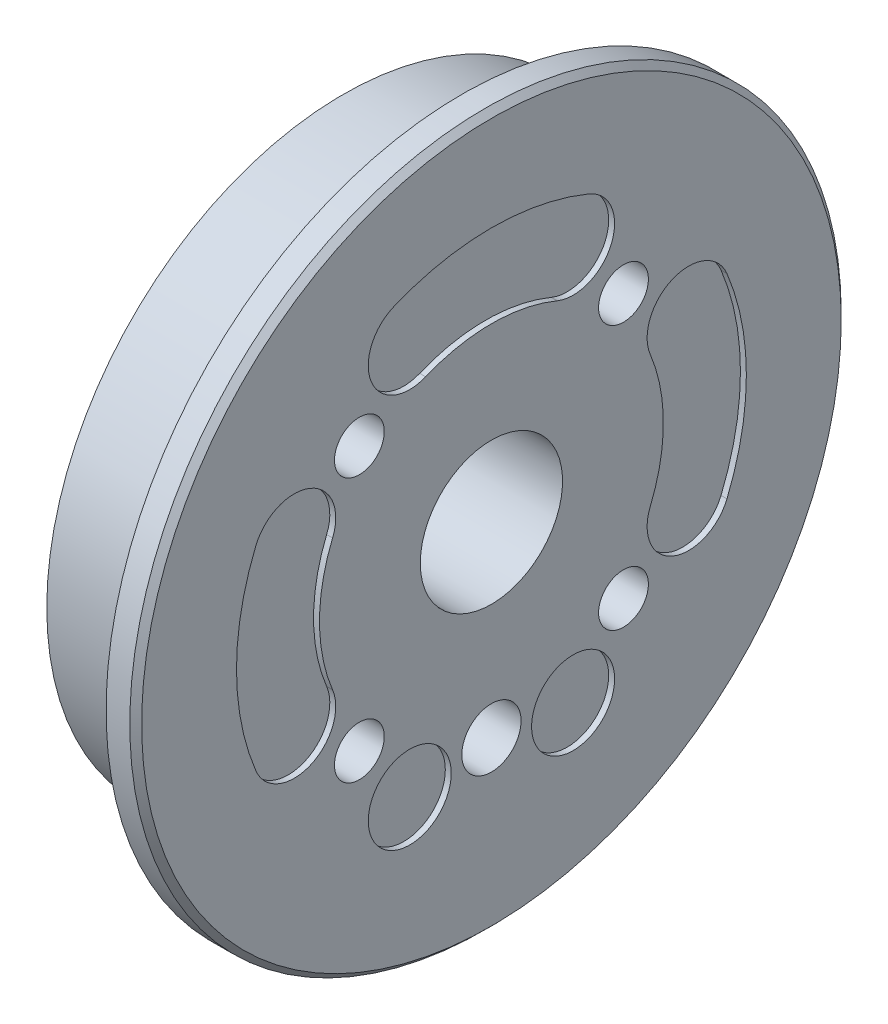
ISO-10303-21;
HEADER;
FILE_DESCRIPTION(('STEP AP214'),'2;1');
FILE_NAME('part.step','',(''),(''),'','','');
FILE_SCHEMA(('AUTOMOTIVE_DESIGN { 1 0 10303 214 1 1 1 1 }'));
ENDSEC;
DATA;
#1=APPLICATION_CONTEXT('core data for automotive mechanical design processes');
#2=APPLICATION_PROTOCOL_DEFINITION('international standard','automotive_design',2000,#1);
#3=PRODUCT_CONTEXT('',#1,'mechanical');
#4=PRODUCT('Part','Part','',(#3));
#5=PRODUCT_RELATED_PRODUCT_CATEGORY('part','',(#4));
#6=PRODUCT_DEFINITION_FORMATION('','',#4);
#7=PRODUCT_DEFINITION_CONTEXT('part definition',#1,'design');
#8=PRODUCT_DEFINITION('design','',#6,#7);
#9=PRODUCT_DEFINITION_SHAPE('','',#8);
#10=(LENGTH_UNIT() NAMED_UNIT(*) SI_UNIT(.MILLI.,.METRE.));
#11=(NAMED_UNIT(*) PLANE_ANGLE_UNIT() SI_UNIT($,.RADIAN.));
#12=(NAMED_UNIT(*) SI_UNIT($,.STERADIAN.) SOLID_ANGLE_UNIT());
#13=UNCERTAINTY_MEASURE_WITH_UNIT(LENGTH_MEASURE(1.E-05),#10,'distance_accuracy_value','');
#14=(GEOMETRIC_REPRESENTATION_CONTEXT(3) GLOBAL_UNCERTAINTY_ASSIGNED_CONTEXT((#13)) GLOBAL_UNIT_ASSIGNED_CONTEXT((#10,
#11,#12)) REPRESENTATION_CONTEXT('',''));
#15=CARTESIAN_POINT('',(0.,0.,0.));
#16=DIRECTION('',(0.,0.,1.));
#17=DIRECTION('',(1.,0.,0.));
#18=AXIS2_PLACEMENT_3D('',#15,#16,#17);
#19=CARTESIAN_POINT('',(12.5,0.,0.));
#20=DIRECTION('',(1.,0.,0.));
#21=DIRECTION('',(0.,0.,-1.));
#22=AXIS2_PLACEMENT_3D('',#19,#20,#21);
#23=PLANE('',#22);
#24=CARTESIAN_POINT('',(12.5,0.,0.));
#25=DIRECTION('',(1.,0.,0.));
#26=DIRECTION('',(0.,0.,-1.));
#27=AXIS2_PLACEMENT_3D('',#24,#25,#26);
#28=CIRCLE('',#27,29.5);
#29=CARTESIAN_POINT('',(12.5,0.,-29.5));
#30=VERTEX_POINT('',#29);
#31=EDGE_CURVE('E44',#30,#30,#28,.T.);
#32=ORIENTED_EDGE('',*,*,#31,.T.);
#33=EDGE_LOOP('',(#32));
#34=FACE_BOUND('',#33,.T.);
#35=CARTESIAN_POINT('',(12.5,-15.75,0.));
#36=DIRECTION('',(1.,0.,0.));
#37=DIRECTION('',(0.,0.,-1.));
#38=AXIS2_PLACEMENT_3D('',#35,#36,#37);
#39=CIRCLE('',#38,2.49999999999999);
#40=CARTESIAN_POINT('',(12.5,-15.75,-2.49999999999999));
#41=VERTEX_POINT('',#40);
#42=EDGE_CURVE('E383',#41,#41,#39,.T.);
#43=ORIENTED_EDGE('',*,*,#42,.F.);
#44=EDGE_LOOP('',(#43));
#45=FACE_BOUND('',#44,.T.);
#46=CARTESIAN_POINT('',(12.5,-11.13693180369,-11.13693180369));
#47=DIRECTION('',(-1.,0.,0.));
#48=DIRECTION('',(0.,0.,1.));
#49=AXIS2_PLACEMENT_3D('',#46,#47,#48);
#50=CIRCLE('',#49,2.09999999999999);
#51=CARTESIAN_POINT('',(12.5,-11.13693180369,-9.03693180369001));
#52=VERTEX_POINT('',#51);
#53=EDGE_CURVE('E386',#52,#52,#50,.T.);
#54=ORIENTED_EDGE('',*,*,#53,.T.);
#55=EDGE_LOOP('',(#54));
#56=FACE_BOUND('',#55,.T.);
#57=CARTESIAN_POINT('',(12.5,11.13693180369,-11.13693180369));
#58=DIRECTION('',(-1.,0.,0.));
#59=DIRECTION('',(0.,0.,1.));
#60=AXIS2_PLACEMENT_3D('',#57,#58,#59);
#61=CIRCLE('',#60,2.09999999999999);
#62=CARTESIAN_POINT('',(12.5,11.13693180369,-9.03693180369001));
#63=VERTEX_POINT('',#62);
#64=EDGE_CURVE('E396',#63,#63,#61,.T.);
#65=ORIENTED_EDGE('',*,*,#64,.T.);
#66=EDGE_LOOP('',(#65));
#67=FACE_BOUND('',#66,.T.);
#68=CARTESIAN_POINT('',(12.5,11.13693180369,11.13693180369));
#69=DIRECTION('',(-1.,0.,0.));
#70=DIRECTION('',(0.,0.,1.));
#71=AXIS2_PLACEMENT_3D('',#68,#69,#70);
#72=CIRCLE('',#71,2.09999999999999);
#73=CARTESIAN_POINT('',(12.5,11.13693180369,13.23693180369));
#74=VERTEX_POINT('',#73);
#75=EDGE_CURVE('E402',#74,#74,#72,.T.);
#76=ORIENTED_EDGE('',*,*,#75,.T.);
#77=EDGE_LOOP('',(#76));
#78=FACE_BOUND('',#77,.T.);
#79=CARTESIAN_POINT('',(12.5,-11.13693180369,11.13693180369));
#80=DIRECTION('',(-1.,0.,0.));
#81=DIRECTION('',(0.,0.,1.));
#82=AXIS2_PLACEMENT_3D('',#79,#80,#81);
#83=CIRCLE('',#82,2.09999999999999);
#84=CARTESIAN_POINT('',(12.5,-11.13693180369,13.23693180369));
#85=VERTEX_POINT('',#84);
#86=EDGE_CURVE('E408',#85,#85,#83,.T.);
#87=ORIENTED_EDGE('',*,*,#86,.T.);
#88=EDGE_LOOP('',(#87));
#89=FACE_BOUND('',#88,.T.);
#90=CARTESIAN_POINT('',(12.5,-16.6298315852,6.888301782572));
#91=DIRECTION('',(1.,0.,0.));
#92=DIRECTION('',(0.,0.,-1.));
#93=AXIS2_PLACEMENT_3D('',#90,#91,#92);
#94=CIRCLE('',#93,3.49999999999999);
#95=CARTESIAN_POINT('',(12.5,-16.6298315852,3.38830178257201));
#96=VERTEX_POINT('',#95);
#97=EDGE_CURVE('E411',#96,#96,#94,.T.);
#98=ORIENTED_EDGE('',*,*,#97,.F.);
#99=EDGE_LOOP('',(#98));
#100=FACE_BOUND('',#99,.T.);
#101=CARTESIAN_POINT('',(12.5,-16.6298315852,-6.888301782572));
#102=DIRECTION('',(1.,0.,0.));
#103=DIRECTION('',(0.,0.,-1.));
#104=AXIS2_PLACEMENT_3D('',#101,#102,#103);
#105=CIRCLE('',#104,3.49999999999999);
#106=CARTESIAN_POINT('',(12.5,-16.6298315852,-10.388301782572));
#107=VERTEX_POINT('',#106);
#108=EDGE_CURVE('E417',#107,#107,#105,.T.);
#109=ORIENTED_EDGE('',*,*,#108,.F.);
#110=EDGE_LOOP('',(#109));
#111=FACE_BOUND('',#110,.T.);
#112=CARTESIAN_POINT('',(12.5,0.,0.));
#113=DIRECTION('',(-1.,0.,0.));
#114=DIRECTION('',(0.,0.,1.));
#115=AXIS2_PLACEMENT_3D('',#112,#113,#114);
#116=CIRCLE('',#115,5.99999999999999);
#117=CARTESIAN_POINT('',(12.5,0.,5.99999999999999));
#118=VERTEX_POINT('',#117);
#119=EDGE_CURVE('E151',#118,#118,#116,.T.);
#120=ORIENTED_EDGE('',*,*,#119,.T.);
#121=EDGE_LOOP('',(#120));
#122=FACE_BOUND('',#121,.T.);
#123=CARTESIAN_POINT('',(12.5,16.6298315852,6.888301782572));
#124=DIRECTION('',(1.,0.,0.));
#125=DIRECTION('',(0.,0.,-1.));
#126=AXIS2_PLACEMENT_3D('',#123,#124,#125);
#127=CIRCLE('',#126,3.5000000000014);
#128=CARTESIAN_POINT('',(12.5,19.8634099489907,8.22769379585063));
#129=VERTEX_POINT('',#128);
#130=CARTESIAN_POINT('',(12.5,13.3962532214093,5.54890976929337));
#131=VERTEX_POINT('',#130);
#132=EDGE_CURVE('E59',#129,#131,#127,.T.);
#133=ORIENTED_EDGE('',*,*,#132,.F.);
#134=CARTESIAN_POINT('',(12.5,-2.57086019139763E-12,-1.06425285251177E-12));
#135=DIRECTION('',(1.,0.,0.));
#136=DIRECTION('',(0.,0.,-1.));
#137=AXIS2_PLACEMENT_3D('',#134,#135,#136);
#138=CIRCLE('',#137,21.5000000000014);
#139=CARTESIAN_POINT('',(12.5,19.8634099489907,-8.22769379585276));
#140=VERTEX_POINT('',#139);
#141=EDGE_CURVE('E170',#140,#129,#138,.T.);
#142=ORIENTED_EDGE('',*,*,#141,.F.);
#143=CARTESIAN_POINT('',(12.5,16.6298315852,-6.88830178257413));
#144=DIRECTION('',(1.,0.,0.));
#145=DIRECTION('',(0.,0.,-1.));
#146=AXIS2_PLACEMENT_3D('',#143,#144,#145);
#147=CIRCLE('',#146,3.5000000000014);
#148=CARTESIAN_POINT('',(12.5,13.3962532214093,-5.5489097692955));
#149=VERTEX_POINT('',#148);
#150=EDGE_CURVE('E184',#149,#140,#147,.T.);
#151=ORIENTED_EDGE('',*,*,#150,.F.);
#152=CARTESIAN_POINT('',(12.5,-2.57086019139763E-12,-1.06425285251177E-12));
#153=DIRECTION('',(-1.,0.,0.));
#154=DIRECTION('',(0.,0.,1.));
#155=AXIS2_PLACEMENT_3D('',#152,#153,#154);
#156=CIRCLE('',#155,14.4999999999986);
#157=EDGE_CURVE('E181',#131,#149,#156,.T.);
#158=ORIENTED_EDGE('',*,*,#157,.F.);
#159=EDGE_LOOP('',(#133,#142,#151,#158));
#160=FACE_BOUND('',#159,.T.);
#161=CARTESIAN_POINT('',(12.5,6.88830178257226,-16.6298315852006));
#162=DIRECTION('',(1.,0.,0.));
#163=DIRECTION('',(0.,0.,-1.));
#164=AXIS2_PLACEMENT_3D('',#161,#162,#163);
#165=CIRCLE('',#164,3.4999999999993);
#166=CARTESIAN_POINT('',(12.5,8.22769379585008,-19.8634099489894));
#167=VERTEX_POINT('',#166);
#168=CARTESIAN_POINT('',(12.5,5.54890976929443,-13.3962532214119));
#169=VERTEX_POINT('',#168);
#170=EDGE_CURVE('E191',#167,#169,#165,.T.);
#171=ORIENTED_EDGE('',*,*,#170,.F.);
#172=CARTESIAN_POINT('',(12.5,0.,0.));
#173=DIRECTION('',(1.,0.,0.));
#174=DIRECTION('',(0.,0.,-1.));
#175=AXIS2_PLACEMENT_3D('',#172,#173,#174);
#176=CIRCLE('',#175,21.4999999999972);
#177=CARTESIAN_POINT('',(12.5,-8.22769379585009,-19.8634099489894));
#178=VERTEX_POINT('',#177);
#179=EDGE_CURVE('E201',#178,#167,#176,.T.);
#180=ORIENTED_EDGE('',*,*,#179,.F.);
#181=CARTESIAN_POINT('',(12.5,-6.88830178257226,-16.6298315852006));
#182=DIRECTION('',(1.,0.,0.));
#183=DIRECTION('',(0.,0.,-1.));
#184=AXIS2_PLACEMENT_3D('',#181,#182,#183);
#185=CIRCLE('',#184,3.4999999999993);
#186=CARTESIAN_POINT('',(12.5,-5.54890976929443,-13.3962532214119));
#187=VERTEX_POINT('',#186);
#188=EDGE_CURVE('E215',#187,#178,#185,.T.);
#189=ORIENTED_EDGE('',*,*,#188,.F.);
#190=CARTESIAN_POINT('',(12.5,0.,0.));
#191=DIRECTION('',(-1.,0.,0.));
#192=DIRECTION('',(0.,0.,1.));
#193=AXIS2_PLACEMENT_3D('',#190,#191,#192);
#194=CIRCLE('',#193,14.4999999999986);
#195=EDGE_CURVE('E212',#169,#187,#194,.T.);
#196=ORIENTED_EDGE('',*,*,#195,.F.);
#197=EDGE_LOOP('',(#171,#180,#189,#196));
#198=FACE_BOUND('',#197,.T.);
#199=CARTESIAN_POINT('',(12.5,-6.888301782572,16.6298315852));
#200=DIRECTION('',(1.,0.,0.));
#201=DIRECTION('',(0.,0.,-1.));
#202=AXIS2_PLACEMENT_3D('',#199,#200,#201);
#203=CIRCLE('',#202,3.5000000000014);
#204=CARTESIAN_POINT('',(12.5,-8.22769379585063,19.8634099489907));
#205=VERTEX_POINT('',#204);
#206=CARTESIAN_POINT('',(12.5,-5.54890976929337,13.3962532214093));
#207=VERTEX_POINT('',#206);
#208=EDGE_CURVE('E51',#205,#207,#203,.T.);
#209=ORIENTED_EDGE('',*,*,#208,.F.);
#210=CARTESIAN_POINT('',(12.5,1.06425285251177E-12,-2.57086019139763E-12));
#211=DIRECTION('',(1.,0.,0.));
#212=DIRECTION('',(0.,0.,-1.));
#213=AXIS2_PLACEMENT_3D('',#210,#211,#212);
#214=CIRCLE('',#213,21.5000000000014);
#215=CARTESIAN_POINT('',(12.5,8.22769379585276,19.8634099489907));
#216=VERTEX_POINT('',#215);
#217=EDGE_CURVE('E145',#216,#205,#214,.T.);
#218=ORIENTED_EDGE('',*,*,#217,.F.);
#219=CARTESIAN_POINT('',(12.5,6.88830178257413,16.6298315852));
#220=DIRECTION('',(1.,0.,0.));
#221=DIRECTION('',(0.,0.,-1.));
#222=AXIS2_PLACEMENT_3D('',#219,#220,#221);
#223=CIRCLE('',#222,3.5000000000014);
#224=CARTESIAN_POINT('',(12.5,5.54890976929549,13.3962532214093));
#225=VERTEX_POINT('',#224);
#226=EDGE_CURVE('E148',#225,#216,#223,.T.);
#227=ORIENTED_EDGE('',*,*,#226,.F.);
#228=CARTESIAN_POINT('',(12.5,1.06425285251177E-12,-2.57086019139763E-12));
#229=DIRECTION('',(-1.,0.,0.));
#230=DIRECTION('',(0.,0.,1.));
#231=AXIS2_PLACEMENT_3D('',#228,#229,#230);
#232=CIRCLE('',#231,14.4999999999986);
#233=EDGE_CURVE('E157',#207,#225,#232,.T.);
#234=ORIENTED_EDGE('',*,*,#233,.F.);
#235=EDGE_LOOP('',(#209,#218,#227,#234));
#236=FACE_BOUND('',#235,.T.);
#237=ADVANCED_FACE('F35',(#34,#45,#56,#67,#78,#89,#100,#111,#122,#160,#198,#236),#23,.T.);
#238=CARTESIAN_POINT('',(10.,0.,0.));
#239=DIRECTION('',(1.,0.,0.));
#240=DIRECTION('',(0.,0.,-1.));
#241=AXIS2_PLACEMENT_3D('',#238,#239,#240);
#242=CYLINDRICAL_SURFACE('',#241,30.);
#243=CARTESIAN_POINT('',(12.0000000000001,0.,0.));
#244=DIRECTION('',(1.,0.,0.));
#245=DIRECTION('',(0.,0.,-1.));
#246=AXIS2_PLACEMENT_3D('',#243,#244,#245);
#247=CIRCLE('',#246,30.);
#248=CARTESIAN_POINT('',(12.0000000000001,0.,-30.));
#249=VERTEX_POINT('',#248);
#250=EDGE_CURVE('E11',#249,#249,#247,.F.);
#251=ORIENTED_EDGE('',*,*,#250,.T.);
#252=EDGE_LOOP('',(#251));
#253=FACE_BOUND('',#252,.T.);
#254=CARTESIAN_POINT('',(10.,0.,0.));
#255=DIRECTION('',(1.,0.,0.));
#256=DIRECTION('',(0.,0.,-1.));
#257=AXIS2_PLACEMENT_3D('',#254,#255,#256);
#258=CIRCLE('',#257,30.);
#259=CARTESIAN_POINT('',(10.,0.,-30.));
#260=VERTEX_POINT('',#259);
#261=EDGE_CURVE('E231',#260,#260,#258,.T.);
#262=ORIENTED_EDGE('',*,*,#261,.T.);
#263=EDGE_LOOP('',(#262));
#264=FACE_BOUND('',#263,.T.);
#265=ADVANCED_FACE('F252',(#253,#264),#242,.T.);
#266=CARTESIAN_POINT('',(10.,30.,0.));
#267=DIRECTION('',(-1.,0.,0.));
#268=DIRECTION('',(0.,0.,1.));
#269=AXIS2_PLACEMENT_3D('',#266,#267,#268);
#270=PLANE('',#269);
#271=CARTESIAN_POINT('',(10.,0.,0.));
#272=DIRECTION('',(-1.,0.,0.));
#273=DIRECTION('',(0.,0.,1.));
#274=AXIS2_PLACEMENT_3D('',#271,#272,#273);
#275=CIRCLE('',#274,25.);
#276=CARTESIAN_POINT('',(10.,0.,25.));
#277=VERTEX_POINT('',#276);
#278=EDGE_CURVE('E232',#277,#277,#275,.T.);
#279=ORIENTED_EDGE('',*,*,#278,.F.);
#280=EDGE_LOOP('',(#279));
#281=FACE_BOUND('',#280,.T.);
#282=ORIENTED_EDGE('',*,*,#261,.F.);
#283=EDGE_LOOP('',(#282));
#284=FACE_BOUND('',#283,.T.);
#285=ADVANCED_FACE('F257',(#281,#284),#270,.T.);
#286=CARTESIAN_POINT('',(0.,0.,0.));
#287=DIRECTION('',(1.,0.,0.));
#288=DIRECTION('',(0.,0.,-1.));
#289=AXIS2_PLACEMENT_3D('',#286,#287,#288);
#290=CYLINDRICAL_SURFACE('',#289,25.);
#291=CARTESIAN_POINT('',(0.,0.,0.));
#292=DIRECTION('',(-1.,0.,0.));
#293=DIRECTION('',(0.,0.,1.));
#294=AXIS2_PLACEMENT_3D('',#291,#292,#293);
#295=CIRCLE('',#294,25.);
#296=CARTESIAN_POINT('',(0.,0.,25.));
#297=VERTEX_POINT('',#296);
#298=EDGE_CURVE('E222',#297,#297,#295,.T.);
#299=ORIENTED_EDGE('',*,*,#298,.F.);
#300=EDGE_LOOP('',(#299));
#301=FACE_BOUND('',#300,.T.);
#302=ORIENTED_EDGE('',*,*,#278,.T.);
#303=EDGE_LOOP('',(#302));
#304=FACE_BOUND('',#303,.T.);
#305=ADVANCED_FACE('F261',(#301,#304),#290,.T.);
#306=CARTESIAN_POINT('',(0.,0.,0.));
#307=DIRECTION('',(-1.,0.,0.));
#308=DIRECTION('',(0.,0.,1.));
#309=AXIS2_PLACEMENT_3D('',#306,#307,#308);
#310=PLANE('',#309);
#311=CARTESIAN_POINT('',(0.,-11.13693180369,-11.13693180369));
#312=DIRECTION('',(-1.,0.,0.));
#313=DIRECTION('',(0.,0.,1.));
#314=AXIS2_PLACEMENT_3D('',#311,#312,#313);
#315=CIRCLE('',#314,2.09999999999999);
#316=CARTESIAN_POINT('',(0.,-11.13693180369,-9.03693180369001));
#317=VERTEX_POINT('',#316);
#318=EDGE_CURVE('E382',#317,#317,#315,.T.);
#319=ORIENTED_EDGE('',*,*,#318,.F.);
#320=EDGE_LOOP('',(#319));
#321=FACE_BOUND('',#320,.T.);
#322=CARTESIAN_POINT('',(0.,11.13693180369,-11.13693180369));
#323=DIRECTION('',(-1.,0.,0.));
#324=DIRECTION('',(0.,0.,1.));
#325=AXIS2_PLACEMENT_3D('',#322,#323,#324);
#326=CIRCLE('',#325,2.09999999999999);
#327=CARTESIAN_POINT('',(0.,11.13693180369,-9.03693180369001));
#328=VERTEX_POINT('',#327);
#329=EDGE_CURVE('E393',#328,#328,#326,.T.);
#330=ORIENTED_EDGE('',*,*,#329,.F.);
#331=EDGE_LOOP('',(#330));
#332=FACE_BOUND('',#331,.T.);
#333=CARTESIAN_POINT('',(0.,11.13693180369,11.13693180369));
#334=DIRECTION('',(-1.,0.,0.));
#335=DIRECTION('',(0.,0.,1.));
#336=AXIS2_PLACEMENT_3D('',#333,#334,#335);
#337=CIRCLE('',#336,2.09999999999999);
#338=CARTESIAN_POINT('',(0.,11.13693180369,13.23693180369));
#339=VERTEX_POINT('',#338);
#340=EDGE_CURVE('E399',#339,#339,#337,.T.);
#341=ORIENTED_EDGE('',*,*,#340,.F.);
#342=EDGE_LOOP('',(#341));
#343=FACE_BOUND('',#342,.T.);
#344=CARTESIAN_POINT('',(0.,-11.13693180369,11.13693180369));
#345=DIRECTION('',(-1.,0.,0.));
#346=DIRECTION('',(0.,0.,1.));
#347=AXIS2_PLACEMENT_3D('',#344,#345,#346);
#348=CIRCLE('',#347,2.09999999999999);
#349=CARTESIAN_POINT('',(0.,-11.13693180369,13.23693180369));
#350=VERTEX_POINT('',#349);
#351=EDGE_CURVE('E405',#350,#350,#348,.T.);
#352=ORIENTED_EDGE('',*,*,#351,.F.);
#353=EDGE_LOOP('',(#352));
#354=FACE_BOUND('',#353,.T.);
#355=CARTESIAN_POINT('',(0.,0.,0.));
#356=DIRECTION('',(-1.,0.,0.));
#357=DIRECTION('',(0.,0.,1.));
#358=AXIS2_PLACEMENT_3D('',#355,#356,#357);
#359=CIRCLE('',#358,5.99999999999999);
#360=CARTESIAN_POINT('',(0.,0.,5.99999999999999));
#361=VERTEX_POINT('',#360);
#362=EDGE_CURVE('E422',#361,#361,#359,.T.);
#363=ORIENTED_EDGE('',*,*,#362,.F.);
#364=EDGE_LOOP('',(#363));
#365=FACE_BOUND('',#364,.T.);
#366=ORIENTED_EDGE('',*,*,#298,.T.);
#367=EDGE_LOOP('',(#366));
#368=FACE_BOUND('',#367,.T.);
#369=ADVANCED_FACE('F268',(#321,#332,#343,#354,#365,#368),#310,.T.);
#370=CARTESIAN_POINT('',(12.,6.88830178257226,-16.6298315852006));
#371=DIRECTION('',(1.,0.,0.));
#372=DIRECTION('',(0.,0.,-1.));
#373=AXIS2_PLACEMENT_3D('',#370,#371,#372);
#374=CYLINDRICAL_SURFACE('',#373,3.4999999999993);
#375=ORIENTED_EDGE('',*,*,#170,.T.);
#376=DIRECTION('',(1.,0.,0.));
#377=VECTOR('',#376,1.);
#378=CARTESIAN_POINT('',(12.,5.54890976929443,-13.3962532214119));
#379=LINE('',#378,#377);
#380=CARTESIAN_POINT('',(12.,5.54890976929443,-13.3962532214119));
#381=VERTEX_POINT('',#380);
#382=EDGE_CURVE('E210',#381,#169,#379,.T.);
#383=ORIENTED_EDGE('',*,*,#382,.F.);
#384=CARTESIAN_POINT('',(12.,6.88830178257226,-16.6298315852006));
#385=DIRECTION('',(1.,0.,0.));
#386=DIRECTION('',(0.,0.,-1.));
#387=AXIS2_PLACEMENT_3D('',#384,#385,#386);
#388=CIRCLE('',#387,3.4999999999993);
#389=CARTESIAN_POINT('',(12.,8.22769379585008,-19.8634099489894));
#390=VERTEX_POINT('',#389);
#391=EDGE_CURVE('E197',#390,#381,#388,.T.);
#392=ORIENTED_EDGE('',*,*,#391,.F.);
#393=DIRECTION('',(1.,0.,0.));
#394=VECTOR('',#393,1.);
#395=CARTESIAN_POINT('',(12.,8.22769379585008,-19.8634099489894));
#396=LINE('',#395,#394);
#397=EDGE_CURVE('E220',#390,#167,#396,.T.);
#398=ORIENTED_EDGE('',*,*,#397,.T.);
#399=EDGE_LOOP('',(#375,#383,#392,#398));
#400=FACE_BOUND('',#399,.T.);
#401=ADVANCED_FACE('F278',(#400),#374,.F.);
#402=CARTESIAN_POINT('',(12.,0.,0.));
#403=DIRECTION('',(1.,0.,0.));
#404=DIRECTION('',(0.,0.,-1.));
#405=AXIS2_PLACEMENT_3D('',#402,#403,#404);
#406=CYLINDRICAL_SURFACE('',#405,21.4999999999972);
#407=ORIENTED_EDGE('',*,*,#179,.T.);
#408=ORIENTED_EDGE('',*,*,#397,.F.);
#409=CARTESIAN_POINT('',(12.,0.,0.));
#410=DIRECTION('',(1.,0.,0.));
#411=DIRECTION('',(0.,0.,-1.));
#412=AXIS2_PLACEMENT_3D('',#409,#410,#411);
#413=CIRCLE('',#412,21.4999999999972);
#414=CARTESIAN_POINT('',(12.,-8.22769379585009,-19.8634099489894));
#415=VERTEX_POINT('',#414);
#416=EDGE_CURVE('E207',#415,#390,#413,.T.);
#417=ORIENTED_EDGE('',*,*,#416,.F.);
#418=DIRECTION('',(1.,0.,0.));
#419=VECTOR('',#418,1.);
#420=CARTESIAN_POINT('',(12.,-8.22769379585009,-19.8634099489894));
#421=LINE('',#420,#419);
#422=EDGE_CURVE('E223',#415,#178,#421,.T.);
#423=ORIENTED_EDGE('',*,*,#422,.T.);
#424=EDGE_LOOP('',(#407,#408,#417,#423));
#425=FACE_BOUND('',#424,.T.);
#426=ADVANCED_FACE('F285',(#425),#406,.F.);
#427=CARTESIAN_POINT('',(12.,-6.88830178257226,-16.6298315852006));
#428=DIRECTION('',(1.,0.,0.));
#429=DIRECTION('',(0.,0.,-1.));
#430=AXIS2_PLACEMENT_3D('',#427,#428,#429);
#431=CYLINDRICAL_SURFACE('',#430,3.4999999999993);
#432=ORIENTED_EDGE('',*,*,#188,.T.);
#433=ORIENTED_EDGE('',*,*,#422,.F.);
#434=CARTESIAN_POINT('',(12.,-6.88830178257226,-16.6298315852006));
#435=DIRECTION('',(1.,0.,0.));
#436=DIRECTION('',(0.,0.,-1.));
#437=AXIS2_PLACEMENT_3D('',#434,#435,#436);
#438=CIRCLE('',#437,3.4999999999993);
#439=CARTESIAN_POINT('',(12.,-5.54890976929443,-13.3962532214119));
#440=VERTEX_POINT('',#439);
#441=EDGE_CURVE('E204',#440,#415,#438,.T.);
#442=ORIENTED_EDGE('',*,*,#441,.F.);
#443=DIRECTION('',(1.,0.,0.));
#444=VECTOR('',#443,1.);
#445=CARTESIAN_POINT('',(12.,-5.54890976929443,-13.3962532214119));
#446=LINE('',#445,#444);
#447=EDGE_CURVE('E225',#440,#187,#446,.T.);
#448=ORIENTED_EDGE('',*,*,#447,.T.);
#449=EDGE_LOOP('',(#432,#433,#442,#448));
#450=FACE_BOUND('',#449,.T.);
#451=ADVANCED_FACE('F295',(#450),#431,.F.);
#452=CARTESIAN_POINT('',(12.,0.,0.));
#453=DIRECTION('',(1.,0.,0.));
#454=DIRECTION('',(0.,0.,-1.));
#455=AXIS2_PLACEMENT_3D('',#452,#453,#454);
#456=CYLINDRICAL_SURFACE('',#455,14.4999999999986);
#457=ORIENTED_EDGE('',*,*,#195,.T.);
#458=ORIENTED_EDGE('',*,*,#447,.F.);
#459=CARTESIAN_POINT('',(12.,0.,0.));
#460=DIRECTION('',(-1.,0.,0.));
#461=DIRECTION('',(0.,0.,1.));
#462=AXIS2_PLACEMENT_3D('',#459,#460,#461);
#463=CIRCLE('',#462,14.4999999999986);
#464=EDGE_CURVE('E200',#381,#440,#463,.T.);
#465=ORIENTED_EDGE('',*,*,#464,.F.);
#466=ORIENTED_EDGE('',*,*,#382,.T.);
#467=EDGE_LOOP('',(#457,#458,#465,#466));
#468=FACE_BOUND('',#467,.T.);
#469=ADVANCED_FACE('F291',(#468),#456,.T.);
#470=CARTESIAN_POINT('',(12.,3.44415089128613,-8.31491579260032));
#471=DIRECTION('',(1.,0.,0.));
#472=DIRECTION('',(0.,0.,-1.));
#473=AXIS2_PLACEMENT_3D('',#470,#471,#472);
#474=PLANE('',#473);
#475=ORIENTED_EDGE('',*,*,#391,.T.);
#476=ORIENTED_EDGE('',*,*,#464,.T.);
#477=ORIENTED_EDGE('',*,*,#441,.T.);
#478=ORIENTED_EDGE('',*,*,#416,.T.);
#479=EDGE_LOOP('',(#475,#476,#477,#478));
#480=FACE_BOUND('',#479,.T.);
#481=ADVANCED_FACE('F294',(#480),#474,.T.);
#482=CARTESIAN_POINT('',(12.,16.6298315852,6.888301782572));
#483=DIRECTION('',(1.,0.,0.));
#484=DIRECTION('',(0.,0.,-1.));
#485=AXIS2_PLACEMENT_3D('',#482,#483,#484);
#486=CYLINDRICAL_SURFACE('',#485,3.5000000000014);
#487=ORIENTED_EDGE('',*,*,#132,.T.);
#488=DIRECTION('',(1.,0.,0.));
#489=VECTOR('',#488,1.);
#490=CARTESIAN_POINT('',(12.,13.3962532214093,5.54890976929337));
#491=LINE('',#490,#489);
#492=CARTESIAN_POINT('',(12.,13.3962532214093,5.54890976929337));
#493=VERTEX_POINT('',#492);
#494=EDGE_CURVE('E179',#493,#131,#491,.T.);
#495=ORIENTED_EDGE('',*,*,#494,.F.);
#496=CARTESIAN_POINT('',(12.,16.6298315852,6.888301782572));
#497=DIRECTION('',(1.,0.,0.));
#498=DIRECTION('',(0.,0.,-1.));
#499=AXIS2_PLACEMENT_3D('',#496,#497,#498);
#500=CIRCLE('',#499,3.5000000000014);
#501=CARTESIAN_POINT('',(12.,19.8634099489907,8.22769379585063));
#502=VERTEX_POINT('',#501);
#503=EDGE_CURVE('E166',#502,#493,#500,.T.);
#504=ORIENTED_EDGE('',*,*,#503,.F.);
#505=DIRECTION('',(1.,0.,0.));
#506=VECTOR('',#505,1.);
#507=CARTESIAN_POINT('',(12.,19.8634099489907,8.22769379585063));
#508=LINE('',#507,#506);
#509=EDGE_CURVE('E189',#502,#129,#508,.T.);
#510=ORIENTED_EDGE('',*,*,#509,.T.);
#511=EDGE_LOOP('',(#487,#495,#504,#510));
#512=FACE_BOUND('',#511,.T.);
#513=ADVANCED_FACE('F305',(#512),#486,.F.);
#514=CARTESIAN_POINT('',(12.,-2.57086019139763E-12,-1.06425285251177E-12));
#515=DIRECTION('',(1.,0.,0.));
#516=DIRECTION('',(0.,0.,-1.));
#517=AXIS2_PLACEMENT_3D('',#514,#515,#516);
#518=CYLINDRICAL_SURFACE('',#517,21.5000000000014);
#519=ORIENTED_EDGE('',*,*,#141,.T.);
#520=ORIENTED_EDGE('',*,*,#509,.F.);
#521=CARTESIAN_POINT('',(12.,-2.57086019139763E-12,-1.06425285251177E-12));
#522=DIRECTION('',(1.,0.,0.));
#523=DIRECTION('',(0.,0.,-1.));
#524=AXIS2_PLACEMENT_3D('',#521,#522,#523);
#525=CIRCLE('',#524,21.5000000000014);
#526=CARTESIAN_POINT('',(12.,19.8634099489907,-8.22769379585276));
#527=VERTEX_POINT('',#526);
#528=EDGE_CURVE('E176',#527,#502,#525,.T.);
#529=ORIENTED_EDGE('',*,*,#528,.F.);
#530=DIRECTION('',(1.,0.,0.));
#531=VECTOR('',#530,1.);
#532=CARTESIAN_POINT('',(12.,19.8634099489907,-8.22769379585276));
#533=LINE('',#532,#531);
#534=EDGE_CURVE('E192',#527,#140,#533,.T.);
#535=ORIENTED_EDGE('',*,*,#534,.T.);
#536=EDGE_LOOP('',(#519,#520,#529,#535));
#537=FACE_BOUND('',#536,.T.);
#538=ADVANCED_FACE('F309',(#537),#518,.F.);
#539=CARTESIAN_POINT('',(12.,16.6298315852,-6.88830178257413));
#540=DIRECTION('',(1.,0.,0.));
#541=DIRECTION('',(0.,0.,-1.));
#542=AXIS2_PLACEMENT_3D('',#539,#540,#541);
#543=CYLINDRICAL_SURFACE('',#542,3.5000000000014);
#544=ORIENTED_EDGE('',*,*,#150,.T.);
#545=ORIENTED_EDGE('',*,*,#534,.F.);
#546=CARTESIAN_POINT('',(12.,16.6298315852,-6.88830178257413));
#547=DIRECTION('',(1.,0.,0.));
#548=DIRECTION('',(0.,0.,-1.));
#549=AXIS2_PLACEMENT_3D('',#546,#547,#548);
#550=CIRCLE('',#549,3.5000000000014);
#551=CARTESIAN_POINT('',(12.,13.3962532214093,-5.5489097692955));
#552=VERTEX_POINT('',#551);
#553=EDGE_CURVE('E173',#552,#527,#550,.T.);
#554=ORIENTED_EDGE('',*,*,#553,.F.);
#555=DIRECTION('',(1.,0.,0.));
#556=VECTOR('',#555,1.);
#557=CARTESIAN_POINT('',(12.,13.3962532214093,-5.5489097692955));
#558=LINE('',#557,#556);
#559=EDGE_CURVE('E194',#552,#149,#558,.T.);
#560=ORIENTED_EDGE('',*,*,#559,.T.);
#561=EDGE_LOOP('',(#544,#545,#554,#560));
#562=FACE_BOUND('',#561,.T.);
#563=ADVANCED_FACE('F314',(#562),#543,.F.);
#564=CARTESIAN_POINT('',(12.,-2.57086019139763E-12,-1.06425285251177E-12));
#565=DIRECTION('',(1.,0.,0.));
#566=DIRECTION('',(0.,0.,-1.));
#567=AXIS2_PLACEMENT_3D('',#564,#565,#566);
#568=CYLINDRICAL_SURFACE('',#567,14.4999999999986);
#569=ORIENTED_EDGE('',*,*,#157,.T.);
#570=ORIENTED_EDGE('',*,*,#559,.F.);
#571=CARTESIAN_POINT('',(12.,-2.57086019139763E-12,-1.06425285251177E-12));
#572=DIRECTION('',(-1.,0.,0.));
#573=DIRECTION('',(0.,0.,1.));
#574=AXIS2_PLACEMENT_3D('',#571,#572,#573);
#575=CIRCLE('',#574,14.4999999999986);
#576=EDGE_CURVE('E169',#493,#552,#575,.T.);
#577=ORIENTED_EDGE('',*,*,#576,.F.);
#578=ORIENTED_EDGE('',*,*,#494,.T.);
#579=EDGE_LOOP('',(#569,#570,#577,#578));
#580=FACE_BOUND('',#579,.T.);
#581=ADVANCED_FACE('F310',(#580),#568,.T.);
#582=CARTESIAN_POINT('',(12.,8.31491579259871,3.44415089128547));
#583=DIRECTION('',(1.,0.,0.));
#584=DIRECTION('',(0.,0.,-1.));
#585=AXIS2_PLACEMENT_3D('',#582,#583,#584);
#586=PLANE('',#585);
#587=ORIENTED_EDGE('',*,*,#503,.T.);
#588=ORIENTED_EDGE('',*,*,#576,.T.);
#589=ORIENTED_EDGE('',*,*,#553,.T.);
#590=ORIENTED_EDGE('',*,*,#528,.T.);
#591=EDGE_LOOP('',(#587,#588,#589,#590));
#592=FACE_BOUND('',#591,.T.);
#593=ADVANCED_FACE('F313',(#592),#586,.T.);
#594=CARTESIAN_POINT('',(12.,-6.888301782572,16.6298315852));
#595=DIRECTION('',(1.,0.,0.));
#596=DIRECTION('',(0.,0.,-1.));
#597=AXIS2_PLACEMENT_3D('',#594,#595,#596);
#598=CYLINDRICAL_SURFACE('',#597,3.5000000000014);
#599=ORIENTED_EDGE('',*,*,#208,.T.);
#600=DIRECTION('',(1.,0.,0.));
#601=VECTOR('',#600,1.);
#602=CARTESIAN_POINT('',(12.,-5.54890976929337,13.3962532214093));
#603=LINE('',#602,#601);
#604=CARTESIAN_POINT('',(12.,-5.54890976929337,13.3962532214093));
#605=VERTEX_POINT('',#604);
#606=EDGE_CURVE('E123',#605,#207,#603,.T.);
#607=ORIENTED_EDGE('',*,*,#606,.F.);
#608=CARTESIAN_POINT('',(12.,-6.888301782572,16.6298315852));
#609=DIRECTION('',(1.,0.,0.));
#610=DIRECTION('',(0.,0.,-1.));
#611=AXIS2_PLACEMENT_3D('',#608,#609,#610);
#612=CIRCLE('',#611,3.5000000000014);
#613=CARTESIAN_POINT('',(12.,-8.22769379585063,19.8634099489907));
#614=VERTEX_POINT('',#613);
#615=EDGE_CURVE('E127',#614,#605,#612,.T.);
#616=ORIENTED_EDGE('',*,*,#615,.F.);
#617=DIRECTION('',(1.,0.,0.));
#618=VECTOR('',#617,1.);
#619=CARTESIAN_POINT('',(12.,-8.22769379585063,19.8634099489907));
#620=LINE('',#619,#618);
#621=EDGE_CURVE('E161',#614,#205,#620,.T.);
#622=ORIENTED_EDGE('',*,*,#621,.T.);
#623=EDGE_LOOP('',(#599,#607,#616,#622));
#624=FACE_BOUND('',#623,.T.);
#625=ADVANCED_FACE('F125',(#624),#598,.F.);
#626=CARTESIAN_POINT('',(12.,1.06425285251177E-12,-2.57086019139763E-12));
#627=DIRECTION('',(1.,0.,0.));
#628=DIRECTION('',(0.,0.,-1.));
#629=AXIS2_PLACEMENT_3D('',#626,#627,#628);
#630=CYLINDRICAL_SURFACE('',#629,21.5000000000014);
#631=ORIENTED_EDGE('',*,*,#217,.T.);
#632=ORIENTED_EDGE('',*,*,#621,.F.);
#633=CARTESIAN_POINT('',(12.,1.06425285251177E-12,-2.57086019139763E-12));
#634=DIRECTION('',(1.,0.,0.));
#635=DIRECTION('',(0.,0.,-1.));
#636=AXIS2_PLACEMENT_3D('',#633,#634,#635);
#637=CIRCLE('',#636,21.5000000000014);
#638=CARTESIAN_POINT('',(12.,8.22769379585276,19.8634099489907));
#639=VERTEX_POINT('',#638);
#640=EDGE_CURVE('E133',#639,#614,#637,.T.);
#641=ORIENTED_EDGE('',*,*,#640,.F.);
#642=DIRECTION('',(1.,0.,0.));
#643=VECTOR('',#642,1.);
#644=CARTESIAN_POINT('',(12.,8.22769379585276,19.8634099489907));
#645=LINE('',#644,#643);
#646=EDGE_CURVE('E163',#639,#216,#645,.T.);
#647=ORIENTED_EDGE('',*,*,#646,.T.);
#648=EDGE_LOOP('',(#631,#632,#641,#647));
#649=FACE_BOUND('',#648,.T.);
#650=ADVANCED_FACE('F327',(#649),#630,.F.);
#651=CARTESIAN_POINT('',(12.,6.88830178257413,16.6298315852));
#652=DIRECTION('',(1.,0.,0.));
#653=DIRECTION('',(0.,0.,-1.));
#654=AXIS2_PLACEMENT_3D('',#651,#652,#653);
#655=CYLINDRICAL_SURFACE('',#654,3.5000000000014);
#656=ORIENTED_EDGE('',*,*,#226,.T.);
#657=ORIENTED_EDGE('',*,*,#646,.F.);
#658=CARTESIAN_POINT('',(12.,6.88830178257413,16.6298315852));
#659=DIRECTION('',(1.,0.,0.));
#660=DIRECTION('',(0.,0.,-1.));
#661=AXIS2_PLACEMENT_3D('',#658,#659,#660);
#662=CIRCLE('',#661,3.5000000000014);
#663=CARTESIAN_POINT('',(12.,5.54890976929549,13.3962532214093));
#664=VERTEX_POINT('',#663);
#665=EDGE_CURVE('E141',#664,#639,#662,.T.);
#666=ORIENTED_EDGE('',*,*,#665,.F.);
#667=DIRECTION('',(1.,0.,0.));
#668=VECTOR('',#667,1.);
#669=CARTESIAN_POINT('',(12.,5.54890976929549,13.3962532214093));
#670=LINE('',#669,#668);
#671=EDGE_CURVE('E132',#664,#225,#670,.T.);
#672=ORIENTED_EDGE('',*,*,#671,.T.);
#673=EDGE_LOOP('',(#656,#657,#666,#672));
#674=FACE_BOUND('',#673,.T.);
#675=ADVANCED_FACE('F330',(#674),#655,.F.);
#676=CARTESIAN_POINT('',(12.,1.06425285251177E-12,-2.57086019139763E-12));
#677=DIRECTION('',(1.,0.,0.));
#678=DIRECTION('',(0.,0.,-1.));
#679=AXIS2_PLACEMENT_3D('',#676,#677,#678);
#680=CYLINDRICAL_SURFACE('',#679,14.4999999999986);
#681=ORIENTED_EDGE('',*,*,#233,.T.);
#682=ORIENTED_EDGE('',*,*,#671,.F.);
#683=CARTESIAN_POINT('',(12.,1.06425285251177E-12,-2.57086019139763E-12));
#684=DIRECTION('',(-1.,0.,0.));
#685=DIRECTION('',(0.,0.,1.));
#686=AXIS2_PLACEMENT_3D('',#683,#684,#685);
#687=CIRCLE('',#686,14.4999999999986);
#688=EDGE_CURVE('E136',#605,#664,#687,.T.);
#689=ORIENTED_EDGE('',*,*,#688,.F.);
#690=ORIENTED_EDGE('',*,*,#606,.T.);
#691=EDGE_LOOP('',(#681,#682,#689,#690));
#692=FACE_BOUND('',#691,.T.);
#693=ADVANCED_FACE('F137',(#692),#680,.T.);
#694=CARTESIAN_POINT('',(12.,-3.44415089128547,8.31491579259871));
#695=DIRECTION('',(1.,0.,0.));
#696=DIRECTION('',(0.,0.,-1.));
#697=AXIS2_PLACEMENT_3D('',#694,#695,#696);
#698=PLANE('',#697);
#699=ORIENTED_EDGE('',*,*,#615,.T.);
#700=ORIENTED_EDGE('',*,*,#688,.T.);
#701=ORIENTED_EDGE('',*,*,#665,.T.);
#702=ORIENTED_EDGE('',*,*,#640,.T.);
#703=EDGE_LOOP('',(#699,#700,#701,#702));
#704=FACE_BOUND('',#703,.T.);
#705=ADVANCED_FACE('F143',(#704),#698,.T.);
#706=CARTESIAN_POINT('',(0.,0.,0.));
#707=DIRECTION('',(-1.,0.,0.));
#708=DIRECTION('',(0.,0.,1.));
#709=AXIS2_PLACEMENT_3D('',#706,#707,#708);
#710=CYLINDRICAL_SURFACE('',#709,5.99999999999999);
#711=ORIENTED_EDGE('',*,*,#119,.F.);
#712=EDGE_LOOP('',(#711));
#713=FACE_BOUND('',#712,.T.);
#714=ORIENTED_EDGE('',*,*,#362,.T.);
#715=EDGE_LOOP('',(#714));
#716=FACE_BOUND('',#715,.T.);
#717=ADVANCED_FACE('F339',(#713,#716),#710,.F.);
#718=CARTESIAN_POINT('',(12.,-16.6298315852,-6.888301782572));
#719=DIRECTION('',(-1.,0.,0.));
#720=DIRECTION('',(0.,0.,1.));
#721=AXIS2_PLACEMENT_3D('',#718,#719,#720);
#722=PLANE('',#721);
#723=CARTESIAN_POINT('',(12.,-16.6298315852,-6.888301782572));
#724=DIRECTION('',(1.,0.,0.));
#725=DIRECTION('',(0.,0.,-1.));
#726=AXIS2_PLACEMENT_3D('',#723,#724,#725);
#727=CIRCLE('',#726,3.49999999999999);
#728=CARTESIAN_POINT('',(12.,-16.6298315852,-10.388301782572));
#729=VERTEX_POINT('',#728);
#730=EDGE_CURVE('E420',#729,#729,#727,.T.);
#731=ORIENTED_EDGE('',*,*,#730,.T.);
#732=EDGE_LOOP('',(#731));
#733=FACE_BOUND('',#732,.T.);
#734=ADVANCED_FACE('F342',(#733),#722,.F.);
#735=CARTESIAN_POINT('',(12.5,-16.6298315852,-6.888301782572));
#736=DIRECTION('',(1.,0.,0.));
#737=DIRECTION('',(0.,0.,-1.));
#738=AXIS2_PLACEMENT_3D('',#735,#736,#737);
#739=CYLINDRICAL_SURFACE('',#738,3.49999999999999);
#740=ORIENTED_EDGE('',*,*,#730,.F.);
#741=EDGE_LOOP('',(#740));
#742=FACE_BOUND('',#741,.T.);
#743=ORIENTED_EDGE('',*,*,#108,.T.);
#744=EDGE_LOOP('',(#743));
#745=FACE_BOUND('',#744,.T.);
#746=ADVANCED_FACE('F346',(#742,#745),#739,.F.);
#747=CARTESIAN_POINT('',(12.,-16.6298315852,6.888301782572));
#748=DIRECTION('',(-1.,0.,0.));
#749=DIRECTION('',(0.,0.,1.));
#750=AXIS2_PLACEMENT_3D('',#747,#748,#749);
#751=PLANE('',#750);
#752=CARTESIAN_POINT('',(12.,-16.6298315852,6.888301782572));
#753=DIRECTION('',(1.,0.,0.));
#754=DIRECTION('',(0.,0.,-1.));
#755=AXIS2_PLACEMENT_3D('',#752,#753,#754);
#756=CIRCLE('',#755,3.49999999999999);
#757=CARTESIAN_POINT('',(12.,-16.6298315852,3.38830178257201));
#758=VERTEX_POINT('',#757);
#759=EDGE_CURVE('E414',#758,#758,#756,.T.);
#760=ORIENTED_EDGE('',*,*,#759,.T.);
#761=EDGE_LOOP('',(#760));
#762=FACE_BOUND('',#761,.T.);
#763=ADVANCED_FACE('F350',(#762),#751,.F.);
#764=CARTESIAN_POINT('',(12.5,-16.6298315852,6.888301782572));
#765=DIRECTION('',(1.,0.,0.));
#766=DIRECTION('',(0.,0.,-1.));
#767=AXIS2_PLACEMENT_3D('',#764,#765,#766);
#768=CYLINDRICAL_SURFACE('',#767,3.49999999999999);
#769=ORIENTED_EDGE('',*,*,#759,.F.);
#770=EDGE_LOOP('',(#769));
#771=FACE_BOUND('',#770,.T.);
#772=ORIENTED_EDGE('',*,*,#97,.T.);
#773=EDGE_LOOP('',(#772));
#774=FACE_BOUND('',#773,.T.);
#775=ADVANCED_FACE('F354',(#771,#774),#768,.F.);
#776=CARTESIAN_POINT('',(0.,-11.13693180369,11.13693180369));
#777=DIRECTION('',(-1.,0.,0.));
#778=DIRECTION('',(0.,0.,1.));
#779=AXIS2_PLACEMENT_3D('',#776,#777,#778);
#780=CYLINDRICAL_SURFACE('',#779,2.09999999999999);
#781=ORIENTED_EDGE('',*,*,#86,.F.);
#782=EDGE_LOOP('',(#781));
#783=FACE_BOUND('',#782,.T.);
#784=ORIENTED_EDGE('',*,*,#351,.T.);
#785=EDGE_LOOP('',(#784));
#786=FACE_BOUND('',#785,.T.);
#787=ADVANCED_FACE('F358',(#783,#786),#780,.F.);
#788=CARTESIAN_POINT('',(0.,11.13693180369,11.13693180369));
#789=DIRECTION('',(-1.,0.,0.));
#790=DIRECTION('',(0.,0.,1.));
#791=AXIS2_PLACEMENT_3D('',#788,#789,#790);
#792=CYLINDRICAL_SURFACE('',#791,2.09999999999999);
#793=ORIENTED_EDGE('',*,*,#75,.F.);
#794=EDGE_LOOP('',(#793));
#795=FACE_BOUND('',#794,.T.);
#796=ORIENTED_EDGE('',*,*,#340,.T.);
#797=EDGE_LOOP('',(#796));
#798=FACE_BOUND('',#797,.T.);
#799=ADVANCED_FACE('F362',(#795,#798),#792,.F.);
#800=CARTESIAN_POINT('',(0.,11.13693180369,-11.13693180369));
#801=DIRECTION('',(-1.,0.,0.));
#802=DIRECTION('',(0.,0.,1.));
#803=AXIS2_PLACEMENT_3D('',#800,#801,#802);
#804=CYLINDRICAL_SURFACE('',#803,2.09999999999999);
#805=ORIENTED_EDGE('',*,*,#64,.F.);
#806=EDGE_LOOP('',(#805));
#807=FACE_BOUND('',#806,.T.);
#808=ORIENTED_EDGE('',*,*,#329,.T.);
#809=EDGE_LOOP('',(#808));
#810=FACE_BOUND('',#809,.T.);
#811=ADVANCED_FACE('F366',(#807,#810),#804,.F.);
#812=CARTESIAN_POINT('',(0.,-11.13693180369,-11.13693180369));
#813=DIRECTION('',(-1.,0.,0.));
#814=DIRECTION('',(0.,0.,1.));
#815=AXIS2_PLACEMENT_3D('',#812,#813,#814);
#816=CYLINDRICAL_SURFACE('',#815,2.09999999999999);
#817=ORIENTED_EDGE('',*,*,#53,.F.);
#818=EDGE_LOOP('',(#817));
#819=FACE_BOUND('',#818,.T.);
#820=ORIENTED_EDGE('',*,*,#318,.T.);
#821=EDGE_LOOP('',(#820));
#822=FACE_BOUND('',#821,.T.);
#823=ADVANCED_FACE('F370',(#819,#822),#816,.F.);
#824=CARTESIAN_POINT('',(5.5,-15.75,0.));
#825=DIRECTION('',(-1.,0.,0.));
#826=DIRECTION('',(0.,0.,1.));
#827=AXIS2_PLACEMENT_3D('',#824,#825,#826);
#828=PLANE('',#827);
#829=CARTESIAN_POINT('',(5.49999999999999,-15.75,0.));
#830=DIRECTION('',(1.,0.,0.));
#831=DIRECTION('',(0.,0.,-1.));
#832=AXIS2_PLACEMENT_3D('',#829,#830,#831);
#833=CIRCLE('',#832,2.49999999999999);
#834=CARTESIAN_POINT('',(5.49999999999999,-15.75,-2.49999999999999));
#835=VERTEX_POINT('',#834);
#836=EDGE_CURVE('E381',#835,#835,#833,.T.);
#837=ORIENTED_EDGE('',*,*,#836,.T.);
#838=EDGE_LOOP('',(#837));
#839=FACE_BOUND('',#838,.T.);
#840=ADVANCED_FACE('F247',(#839),#828,.F.);
#841=CARTESIAN_POINT('',(12.5,-15.75,0.));
#842=DIRECTION('',(1.,0.,0.));
#843=DIRECTION('',(0.,0.,-1.));
#844=AXIS2_PLACEMENT_3D('',#841,#842,#843);
#845=CYLINDRICAL_SURFACE('',#844,2.49999999999999);
#846=ORIENTED_EDGE('',*,*,#836,.F.);
#847=EDGE_LOOP('',(#846));
#848=FACE_BOUND('',#847,.T.);
#849=ORIENTED_EDGE('',*,*,#42,.T.);
#850=EDGE_LOOP('',(#849));
#851=FACE_BOUND('',#850,.T.);
#852=ADVANCED_FACE('F242',(#848,#851),#845,.F.);
#853=CARTESIAN_POINT('',(12.5,0.,0.));
#854=DIRECTION('',(-1.,0.,0.));
#855=DIRECTION('',(0.,0.,1.));
#856=AXIS2_PLACEMENT_3D('',#853,#854,#855);
#857=CONICAL_SURFACE('',#856,29.5,0.785398163397584);
#858=ORIENTED_EDGE('',*,*,#250,.F.);
#859=EDGE_LOOP('',(#858));
#860=FACE_BOUND('',#859,.T.);
#861=ORIENTED_EDGE('',*,*,#31,.F.);
#862=EDGE_LOOP('',(#861));
#863=FACE_BOUND('',#862,.T.);
#864=ADVANCED_FACE('F38',(#860,#863),#857,.T.);
#865=CLOSED_SHELL('',(#237,#265,#285,#305,#369,#401,#426,#451,#469,#481,#513,#538,#563,#581,
#593,#625,#650,#675,#693,#705,#717,#734,#746,#763,#775,#787,#799,#811,#823,#840,#852,#864));
#866=MANIFOLD_SOLID_BREP('B2',#865);
#867=ADVANCED_BREP_SHAPE_REPRESENTATION('',(#18,#866),#14);
#868=SHAPE_DEFINITION_REPRESENTATION(#9,#867);
ENDSEC;
END-ISO-10303-21;
